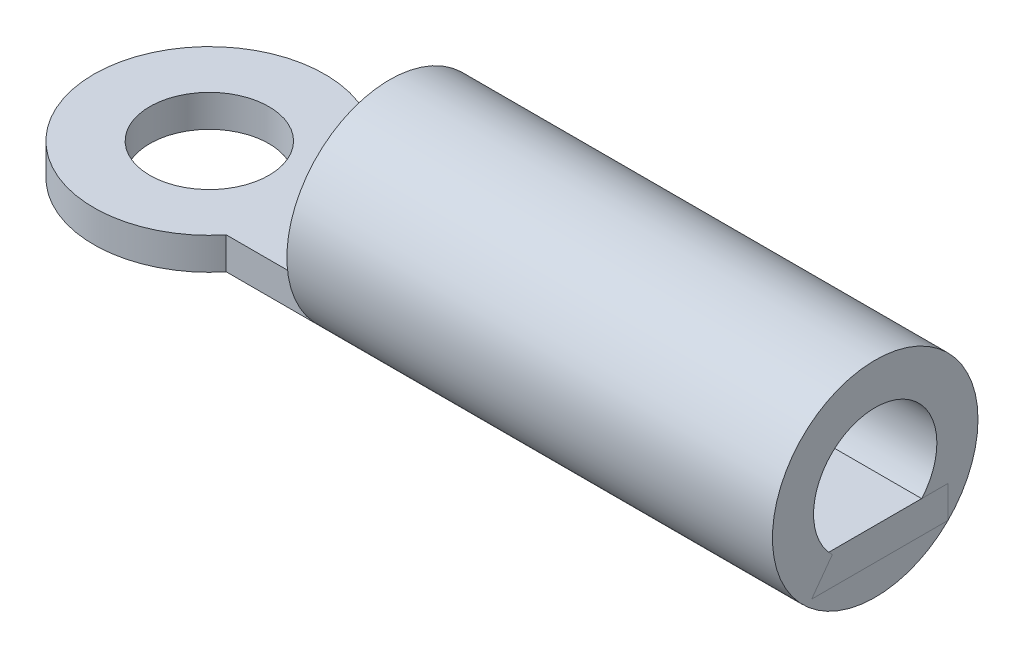
ISO-10303-21;
HEADER;
FILE_DESCRIPTION(('STEP AP214'),'2;1');
FILE_NAME('part.step','',(''),(''),'','','');
FILE_SCHEMA(('AUTOMOTIVE_DESIGN { 1 0 10303 214 1 1 1 1 }'));
ENDSEC;
DATA;
#1=APPLICATION_CONTEXT('core data for automotive mechanical design processes');
#2=APPLICATION_PROTOCOL_DEFINITION('international standard','automotive_design',2000,#1);
#3=PRODUCT_CONTEXT('',#1,'mechanical');
#4=PRODUCT('Part','Part','',(#3));
#5=PRODUCT_RELATED_PRODUCT_CATEGORY('part','',(#4));
#6=PRODUCT_DEFINITION_FORMATION('','',#4);
#7=PRODUCT_DEFINITION_CONTEXT('part definition',#1,'design');
#8=PRODUCT_DEFINITION('design','',#6,#7);
#9=PRODUCT_DEFINITION_SHAPE('','',#8);
#10=(LENGTH_UNIT() NAMED_UNIT(*) SI_UNIT(.MILLI.,.METRE.));
#11=(NAMED_UNIT(*) PLANE_ANGLE_UNIT() SI_UNIT($,.RADIAN.));
#12=(NAMED_UNIT(*) SI_UNIT($,.STERADIAN.) SOLID_ANGLE_UNIT());
#13=UNCERTAINTY_MEASURE_WITH_UNIT(LENGTH_MEASURE(1.E-05),#10,'distance_accuracy_value','');
#14=(GEOMETRIC_REPRESENTATION_CONTEXT(3) GLOBAL_UNCERTAINTY_ASSIGNED_CONTEXT((#13)) GLOBAL_UNIT_ASSIGNED_CONTEXT((#10,
#11,#12)) REPRESENTATION_CONTEXT('',''));
#15=CARTESIAN_POINT('',(0.,0.,0.));
#16=DIRECTION('',(0.,0.,1.));
#17=DIRECTION('',(1.,0.,0.));
#18=AXIS2_PLACEMENT_3D('',#15,#16,#17);
#19=CARTESIAN_POINT('',(5.57000000000001,2.24011718443478,0.));
#20=DIRECTION('',(1.,0.,0.));
#21=DIRECTION('',(0.,0.,-1.));
#22=AXIS2_PLACEMENT_3D('',#19,#20,#21);
#23=CYLINDRICAL_SURFACE('',#22,3.175);
#24=CARTESIAN_POINT('',(5.57000000000001,2.24011718443478,0.));
#25=DIRECTION('',(1.,0.,0.));
#26=DIRECTION('',(0.,0.,-1.));
#27=AXIS2_PLACEMENT_3D('',#24,#25,#26);
#28=CIRCLE('',#27,3.175);
#29=CARTESIAN_POINT('',(5.57000000000001,2.24011718443478,-3.175));
#30=VERTEX_POINT('',#29);
#31=EDGE_CURVE('E11',#30,#30,#28,.T.);
#32=ORIENTED_EDGE('',*,*,#31,.T.);
#33=EDGE_LOOP('',(#32));
#34=FACE_BOUND('',#33,.T.);
#35=CARTESIAN_POINT('',(20.57,2.24011718443478,0.));
#36=DIRECTION('',(1.,0.,0.));
#37=DIRECTION('',(0.,0.,-1.));
#38=AXIS2_PLACEMENT_3D('',#35,#36,#37);
#39=CIRCLE('',#38,3.175);
#40=CARTESIAN_POINT('',(20.57,2.24011718443478,-3.175));
#41=VERTEX_POINT('',#40);
#42=EDGE_CURVE('E44',#41,#41,#39,.T.);
#43=ORIENTED_EDGE('',*,*,#42,.F.);
#44=EDGE_LOOP('',(#43));
#45=FACE_BOUND('',#44,.T.);
#46=ADVANCED_FACE('F41',(#34,#45),#23,.T.);
#47=CARTESIAN_POINT('',(5.57000000000001,2.24011718443478,0.));
#48=DIRECTION('',(1.,0.,0.));
#49=DIRECTION('',(0.,0.,-1.));
#50=AXIS2_PLACEMENT_3D('',#47,#48,#49);
#51=PLANE('',#50);
#52=CARTESIAN_POINT('',(5.57000000000001,2.24011718443478,0.));
#53=DIRECTION('',(1.,0.,0.));
#54=DIRECTION('',(0.,0.,-1.));
#55=AXIS2_PLACEMENT_3D('',#52,#53,#54);
#56=CIRCLE('',#55,1.905);
#57=CARTESIAN_POINT('',(5.57000000000001,2.24011718443478,-1.905));
#58=VERTEX_POINT('',#57);
#59=EDGE_CURVE('E51',#58,#58,#56,.T.);
#60=ORIENTED_EDGE('',*,*,#59,.T.);
#61=EDGE_LOOP('',(#60));
#62=FACE_BOUND('',#61,.T.);
#63=ORIENTED_EDGE('',*,*,#31,.F.);
#64=EDGE_LOOP('',(#63));
#65=FACE_BOUND('',#64,.T.);
#66=ADVANCED_FACE('F59',(#62,#65),#51,.F.);
#67=CARTESIAN_POINT('',(20.57,2.24011718443478,0.));
#68=DIRECTION('',(1.,0.,0.));
#69=DIRECTION('',(0.,0.,-1.));
#70=AXIS2_PLACEMENT_3D('',#67,#68,#69);
#71=PLANE('',#70);
#72=CARTESIAN_POINT('',(20.57,2.24011718443478,0.));
#73=DIRECTION('',(1.,0.,0.));
#74=DIRECTION('',(0.,0.,-1.));
#75=AXIS2_PLACEMENT_3D('',#72,#73,#74);
#76=CIRCLE('',#75,1.905);
#77=CARTESIAN_POINT('',(20.57,2.24011718443478,-1.905));
#78=VERTEX_POINT('',#77);
#79=EDGE_CURVE('E53',#78,#78,#76,.T.);
#80=ORIENTED_EDGE('',*,*,#79,.F.);
#81=EDGE_LOOP('',(#80));
#82=FACE_BOUND('',#81,.T.);
#83=ORIENTED_EDGE('',*,*,#42,.T.);
#84=EDGE_LOOP('',(#83));
#85=FACE_BOUND('',#84,.T.);
#86=ADVANCED_FACE('F65',(#82,#85),#71,.T.);
#87=CARTESIAN_POINT('',(5.57000000000001,2.24011718443478,0.));
#88=DIRECTION('',(1.,0.,0.));
#89=DIRECTION('',(0.,0.,-1.));
#90=AXIS2_PLACEMENT_3D('',#87,#88,#89);
#91=CYLINDRICAL_SURFACE('',#90,1.905);
#92=ORIENTED_EDGE('',*,*,#59,.F.);
#93=EDGE_LOOP('',(#92));
#94=FACE_BOUND('',#93,.T.);
#95=ORIENTED_EDGE('',*,*,#79,.T.);
#96=EDGE_LOOP('',(#95));
#97=FACE_BOUND('',#96,.T.);
#98=ADVANCED_FACE('F62',(#94,#97),#91,.F.);
#99=CLOSED_SHELL('',(#46,#66,#86,#98));
#100=MANIFOLD_SOLID_BREP('B2',#99);
#101=CARTESIAN_POINT('',(0.,0.99,0.));
#102=DIRECTION('',(0.,1.,0.));
#103=DIRECTION('',(0.,0.,1.));
#104=AXIS2_PLACEMENT_3D('',#101,#102,#103);
#105=PLANE('',#104);
#106=CARTESIAN_POINT('',(0.,0.99,0.));
#107=DIRECTION('',(0.,1.,0.));
#108=DIRECTION('',(0.,0.,1.));
#109=AXIS2_PLACEMENT_3D('',#106,#107,#108);
#110=CIRCLE('',#109,3.57);
#111=CARTESIAN_POINT('',(2.77171427098826,0.99,-2.25));
#112=VERTEX_POINT('',#111);
#113=CARTESIAN_POINT('',(2.77171427098826,0.99,2.25));
#114=VERTEX_POINT('',#113);
#115=EDGE_CURVE('E155',#112,#114,#110,.T.);
#116=ORIENTED_EDGE('',*,*,#115,.T.);
#117=DIRECTION('',(1.,0.,0.));
#118=VECTOR('',#117,1.);
#119=CARTESIAN_POINT('',(20.57,0.99,2.25));
#120=LINE('',#119,#118);
#121=CARTESIAN_POINT('',(20.57,0.99,2.25));
#122=VERTEX_POINT('',#121);
#123=EDGE_CURVE('E150',#114,#122,#120,.T.);
#124=ORIENTED_EDGE('',*,*,#123,.T.);
#125=DIRECTION('',(0.,0.,-1.));
#126=VECTOR('',#125,1.);
#127=CARTESIAN_POINT('',(20.57,0.99,-2.25));
#128=LINE('',#127,#126);
#129=CARTESIAN_POINT('',(20.57,0.99,-2.25));
#130=VERTEX_POINT('',#129);
#131=EDGE_CURVE('E153',#122,#130,#128,.T.);
#132=ORIENTED_EDGE('',*,*,#131,.T.);
#133=DIRECTION('',(-1.,0.,0.));
#134=VECTOR('',#133,1.);
#135=CARTESIAN_POINT('',(2.77171427098826,0.99,-2.25));
#136=LINE('',#135,#134);
#137=EDGE_CURVE('E120',#130,#112,#136,.T.);
#138=ORIENTED_EDGE('',*,*,#137,.T.);
#139=EDGE_LOOP('',(#116,#124,#132,#138));
#140=FACE_BOUND('',#139,.T.);
#141=CARTESIAN_POINT('',(0.,0.99,0.));
#142=DIRECTION('',(0.,1.,0.));
#143=DIRECTION('',(0.,0.,1.));
#144=AXIS2_PLACEMENT_3D('',#141,#142,#143);
#145=CIRCLE('',#144,1.84);
#146=CARTESIAN_POINT('',(0.,0.99,1.84));
#147=VERTEX_POINT('',#146);
#148=EDGE_CURVE('E170',#147,#147,#145,.T.);
#149=ORIENTED_EDGE('',*,*,#148,.F.);
#150=EDGE_LOOP('',(#149));
#151=FACE_BOUND('',#150,.T.);
#152=ADVANCED_FACE('F103',(#140,#151),#105,.T.);
#153=CARTESIAN_POINT('',(0.,0.,0.));
#154=DIRECTION('',(0.,1.,0.));
#155=DIRECTION('',(0.,0.,1.));
#156=AXIS2_PLACEMENT_3D('',#153,#154,#155);
#157=PLANE('',#156);
#158=CARTESIAN_POINT('',(0.,0.,0.));
#159=DIRECTION('',(0.,1.,0.));
#160=DIRECTION('',(0.,0.,1.));
#161=AXIS2_PLACEMENT_3D('',#158,#159,#160);
#162=CIRCLE('',#161,3.57);
#163=CARTESIAN_POINT('',(2.77171427098826,0.,-2.25));
#164=VERTEX_POINT('',#163);
#165=CARTESIAN_POINT('',(2.77171427098826,0.,2.25));
#166=VERTEX_POINT('',#165);
#167=EDGE_CURVE('E167',#164,#166,#162,.T.);
#168=ORIENTED_EDGE('',*,*,#167,.F.);
#169=DIRECTION('',(-1.,0.,0.));
#170=VECTOR('',#169,1.);
#171=CARTESIAN_POINT('',(2.77171427098826,0.,-2.25));
#172=LINE('',#171,#170);
#173=CARTESIAN_POINT('',(20.57,0.,-2.25));
#174=VERTEX_POINT('',#173);
#175=EDGE_CURVE('E143',#174,#164,#172,.T.);
#176=ORIENTED_EDGE('',*,*,#175,.F.);
#177=DIRECTION('',(0.,0.,-1.));
#178=VECTOR('',#177,1.);
#179=CARTESIAN_POINT('',(20.57,0.,-2.25));
#180=LINE('',#179,#178);
#181=CARTESIAN_POINT('',(20.57,0.,2.25));
#182=VERTEX_POINT('',#181);
#183=EDGE_CURVE('E137',#182,#174,#180,.T.);
#184=ORIENTED_EDGE('',*,*,#183,.F.);
#185=DIRECTION('',(1.,0.,0.));
#186=VECTOR('',#185,1.);
#187=CARTESIAN_POINT('',(20.57,0.,2.25));
#188=LINE('',#187,#186);
#189=EDGE_CURVE('E159',#166,#182,#188,.T.);
#190=ORIENTED_EDGE('',*,*,#189,.F.);
#191=EDGE_LOOP('',(#168,#176,#184,#190));
#192=FACE_BOUND('',#191,.T.);
#193=CARTESIAN_POINT('',(0.,0.,0.));
#194=DIRECTION('',(0.,1.,0.));
#195=DIRECTION('',(0.,0.,1.));
#196=AXIS2_PLACEMENT_3D('',#193,#194,#195);
#197=CIRCLE('',#196,1.84);
#198=CARTESIAN_POINT('',(0.,0.,1.84));
#199=VERTEX_POINT('',#198);
#200=EDGE_CURVE('E182',#199,#199,#197,.T.);
#201=ORIENTED_EDGE('',*,*,#200,.T.);
#202=EDGE_LOOP('',(#201));
#203=FACE_BOUND('',#202,.T.);
#204=ADVANCED_FACE('F178',(#192,#203),#157,.F.);
#205=CARTESIAN_POINT('',(0.,0.99,0.));
#206=DIRECTION('',(0.,-1.,0.));
#207=DIRECTION('',(0.,0.,-1.));
#208=AXIS2_PLACEMENT_3D('',#205,#206,#207);
#209=CYLINDRICAL_SURFACE('',#208,3.57);
#210=ORIENTED_EDGE('',*,*,#167,.T.);
#211=DIRECTION('',(0.,-1.,0.));
#212=VECTOR('',#211,1.);
#213=CARTESIAN_POINT('',(2.77171427098826,0.99,2.25));
#214=LINE('',#213,#212);
#215=EDGE_CURVE('E39',#114,#166,#214,.T.);
#216=ORIENTED_EDGE('',*,*,#215,.F.);
#217=ORIENTED_EDGE('',*,*,#115,.F.);
#218=DIRECTION('',(0.,-1.,0.));
#219=VECTOR('',#218,1.);
#220=CARTESIAN_POINT('',(2.77171427098826,0.99,-2.25));
#221=LINE('',#220,#219);
#222=EDGE_CURVE('E163',#112,#164,#221,.T.);
#223=ORIENTED_EDGE('',*,*,#222,.T.);
#224=EDGE_LOOP('',(#210,#216,#217,#223));
#225=FACE_BOUND('',#224,.T.);
#226=ADVANCED_FACE('F105',(#225),#209,.T.);
#227=CARTESIAN_POINT('',(20.57,0.99,2.25));
#228=DIRECTION('',(0.,0.,-1.));
#229=DIRECTION('',(-1.,0.,0.));
#230=AXIS2_PLACEMENT_3D('',#227,#228,#229);
#231=PLANE('',#230);
#232=ORIENTED_EDGE('',*,*,#189,.T.);
#233=DIRECTION('',(0.,-1.,0.));
#234=VECTOR('',#233,1.);
#235=CARTESIAN_POINT('',(20.57,0.99,2.25));
#236=LINE('',#235,#234);
#237=EDGE_CURVE('E112',#122,#182,#236,.T.);
#238=ORIENTED_EDGE('',*,*,#237,.F.);
#239=ORIENTED_EDGE('',*,*,#123,.F.);
#240=ORIENTED_EDGE('',*,*,#215,.T.);
#241=EDGE_LOOP('',(#232,#238,#239,#240));
#242=FACE_BOUND('',#241,.T.);
#243=ADVANCED_FACE('F158',(#242),#231,.F.);
#244=CARTESIAN_POINT('',(20.57,0.99,-2.25));
#245=DIRECTION('',(-1.,0.,0.));
#246=DIRECTION('',(0.,0.,1.));
#247=AXIS2_PLACEMENT_3D('',#244,#245,#246);
#248=PLANE('',#247);
#249=ORIENTED_EDGE('',*,*,#183,.T.);
#250=DIRECTION('',(0.,-1.,0.));
#251=VECTOR('',#250,1.);
#252=CARTESIAN_POINT('',(20.57,0.99,-2.25));
#253=LINE('',#252,#251);
#254=EDGE_CURVE('E160',#130,#174,#253,.T.);
#255=ORIENTED_EDGE('',*,*,#254,.F.);
#256=ORIENTED_EDGE('',*,*,#131,.F.);
#257=ORIENTED_EDGE('',*,*,#237,.T.);
#258=EDGE_LOOP('',(#249,#255,#256,#257));
#259=FACE_BOUND('',#258,.T.);
#260=ADVANCED_FACE('F161',(#259),#248,.F.);
#261=CARTESIAN_POINT('',(2.77171427098826,0.99,-2.25));
#262=DIRECTION('',(0.,0.,1.));
#263=DIRECTION('',(1.,0.,0.));
#264=AXIS2_PLACEMENT_3D('',#261,#262,#263);
#265=PLANE('',#264);
#266=ORIENTED_EDGE('',*,*,#175,.T.);
#267=ORIENTED_EDGE('',*,*,#222,.F.);
#268=ORIENTED_EDGE('',*,*,#137,.F.);
#269=ORIENTED_EDGE('',*,*,#254,.T.);
#270=EDGE_LOOP('',(#266,#267,#268,#269));
#271=FACE_BOUND('',#270,.T.);
#272=ADVANCED_FACE('F175',(#271),#265,.F.);
#273=CARTESIAN_POINT('',(0.,0.99,0.));
#274=DIRECTION('',(0.,-1.,0.));
#275=DIRECTION('',(0.,0.,-1.));
#276=AXIS2_PLACEMENT_3D('',#273,#274,#275);
#277=CYLINDRICAL_SURFACE('',#276,1.84);
#278=ORIENTED_EDGE('',*,*,#148,.T.);
#279=EDGE_LOOP('',(#278));
#280=FACE_BOUND('',#279,.T.);
#281=ORIENTED_EDGE('',*,*,#200,.F.);
#282=EDGE_LOOP('',(#281));
#283=FACE_BOUND('',#282,.T.);
#284=ADVANCED_FACE('F188',(#280,#283),#277,.F.);
#285=CLOSED_SHELL('',(#152,#204,#226,#243,#260,#272,#284));
#286=MANIFOLD_SOLID_BREP('B6',#285);
#287=ADVANCED_BREP_SHAPE_REPRESENTATION('',(#18,#100,#286),#14);
#288=SHAPE_DEFINITION_REPRESENTATION(#9,#287);
ENDSEC;
END-ISO-10303-21;
